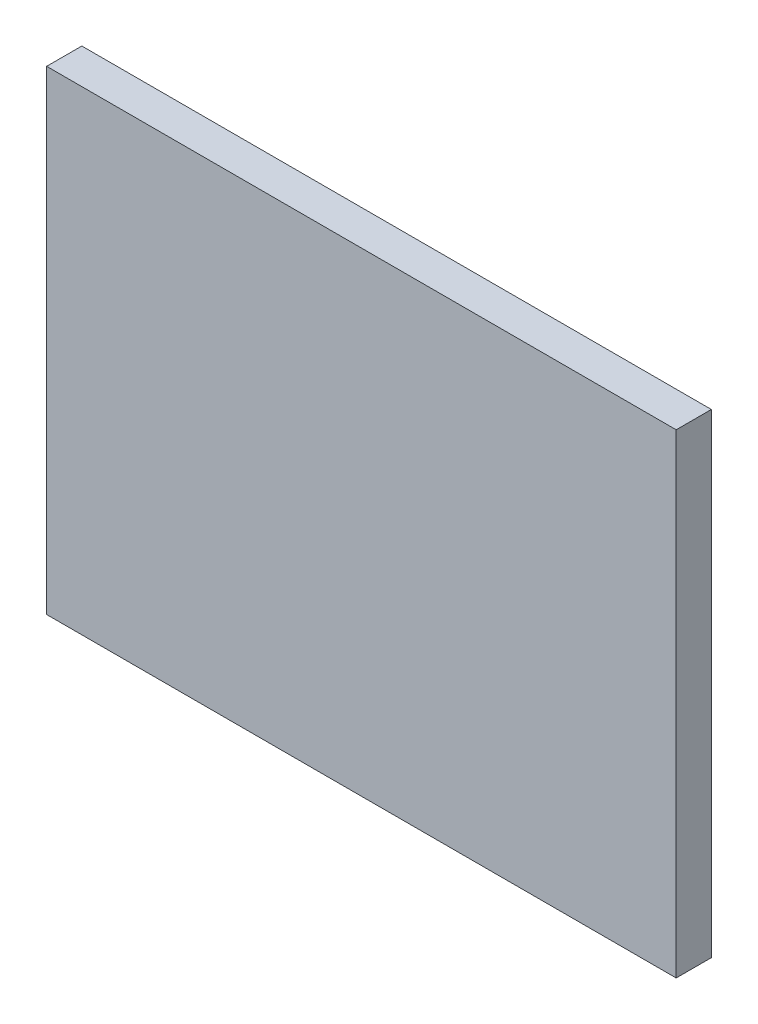
ISO-10303-21;
HEADER;
FILE_DESCRIPTION(('STEP AP214'),'2;1');
FILE_NAME('part.step','',(''),(''),'','','');
FILE_SCHEMA(('AUTOMOTIVE_DESIGN { 1 0 10303 214 1 1 1 1 }'));
ENDSEC;
DATA;
#1=APPLICATION_CONTEXT('core data for automotive mechanical design processes');
#2=APPLICATION_PROTOCOL_DEFINITION('international standard','automotive_design',2000,#1);
#3=PRODUCT_CONTEXT('',#1,'mechanical');
#4=PRODUCT('Part','Part','',(#3));
#5=PRODUCT_RELATED_PRODUCT_CATEGORY('part','',(#4));
#6=PRODUCT_DEFINITION_FORMATION('','',#4);
#7=PRODUCT_DEFINITION_CONTEXT('part definition',#1,'design');
#8=PRODUCT_DEFINITION('design','',#6,#7);
#9=PRODUCT_DEFINITION_SHAPE('','',#8);
#10=(LENGTH_UNIT() NAMED_UNIT(*) SI_UNIT(.MILLI.,.METRE.));
#11=(NAMED_UNIT(*) PLANE_ANGLE_UNIT() SI_UNIT($,.RADIAN.));
#12=(NAMED_UNIT(*) SI_UNIT($,.STERADIAN.) SOLID_ANGLE_UNIT());
#13=UNCERTAINTY_MEASURE_WITH_UNIT(LENGTH_MEASURE(1.E-05),#10,'distance_accuracy_value','');
#14=(GEOMETRIC_REPRESENTATION_CONTEXT(3) GLOBAL_UNCERTAINTY_ASSIGNED_CONTEXT((#13)) GLOBAL_UNIT_ASSIGNED_CONTEXT((#10,
#11,#12)) REPRESENTATION_CONTEXT('',''));
#15=CARTESIAN_POINT('',(0.,0.,0.));
#16=DIRECTION('',(0.,0.,1.));
#17=DIRECTION('',(1.,0.,0.));
#18=AXIS2_PLACEMENT_3D('',#15,#16,#17);
#19=CARTESIAN_POINT('',(17.9,13.5,2.));
#20=DIRECTION('',(-1.,0.,0.));
#21=DIRECTION('',(0.,0.,1.));
#22=AXIS2_PLACEMENT_3D('',#19,#20,#21);
#23=PLANE('',#22);
#24=DIRECTION('',(0.,1.,0.));
#25=VECTOR('',#24,1.);
#26=CARTESIAN_POINT('',(17.9,13.5,0.));
#27=LINE('',#26,#25);
#28=CARTESIAN_POINT('',(17.9,-13.5,0.));
#29=VERTEX_POINT('',#28);
#30=CARTESIAN_POINT('',(17.9,13.5,0.));
#31=VERTEX_POINT('',#30);
#32=EDGE_CURVE('E99',#29,#31,#27,.T.);
#33=ORIENTED_EDGE('',*,*,#32,.T.);
#34=DIRECTION('',(0.,0.,-1.));
#35=VECTOR('',#34,1.);
#36=CARTESIAN_POINT('',(17.9,13.5,2.));
#37=LINE('',#36,#35);
#38=CARTESIAN_POINT('',(17.9,13.5,2.));
#39=VERTEX_POINT('',#38);
#40=EDGE_CURVE('E11',#39,#31,#37,.T.);
#41=ORIENTED_EDGE('',*,*,#40,.F.);
#42=DIRECTION('',(0.,1.,0.));
#43=VECTOR('',#42,1.);
#44=CARTESIAN_POINT('',(17.9,13.5,2.));
#45=LINE('',#44,#43);
#46=CARTESIAN_POINT('',(17.9,-13.5,2.));
#47=VERTEX_POINT('',#46);
#48=EDGE_CURVE('E87',#47,#39,#45,.T.);
#49=ORIENTED_EDGE('',*,*,#48,.F.);
#50=DIRECTION('',(0.,0.,-1.));
#51=VECTOR('',#50,1.);
#52=CARTESIAN_POINT('',(17.9,-13.5,2.));
#53=LINE('',#52,#51);
#54=EDGE_CURVE('E95',#47,#29,#53,.T.);
#55=ORIENTED_EDGE('',*,*,#54,.T.);
#56=EDGE_LOOP('',(#33,#41,#49,#55));
#57=FACE_BOUND('',#56,.T.);
#58=ADVANCED_FACE('F36',(#57),#23,.F.);
#59=CARTESIAN_POINT('',(-17.9,13.5,2.));
#60=DIRECTION('',(0.,-1.,0.));
#61=DIRECTION('',(0.,0.,-1.));
#62=AXIS2_PLACEMENT_3D('',#59,#60,#61);
#63=PLANE('',#62);
#64=DIRECTION('',(-1.,0.,0.));
#65=VECTOR('',#64,1.);
#66=CARTESIAN_POINT('',(-17.9,13.5,0.));
#67=LINE('',#66,#65);
#68=CARTESIAN_POINT('',(-17.9,13.5,0.));
#69=VERTEX_POINT('',#68);
#70=EDGE_CURVE('E91',#31,#69,#67,.T.);
#71=ORIENTED_EDGE('',*,*,#70,.T.);
#72=DIRECTION('',(0.,0.,-1.));
#73=VECTOR('',#72,1.);
#74=CARTESIAN_POINT('',(-17.9,13.5,2.));
#75=LINE('',#74,#73);
#76=CARTESIAN_POINT('',(-17.9,13.5,2.));
#77=VERTEX_POINT('',#76);
#78=EDGE_CURVE('E44',#77,#69,#75,.T.);
#79=ORIENTED_EDGE('',*,*,#78,.F.);
#80=DIRECTION('',(-1.,0.,0.));
#81=VECTOR('',#80,1.);
#82=CARTESIAN_POINT('',(-17.9,13.5,2.));
#83=LINE('',#82,#81);
#84=EDGE_CURVE('E82',#39,#77,#83,.T.);
#85=ORIENTED_EDGE('',*,*,#84,.F.);
#86=ORIENTED_EDGE('',*,*,#40,.T.);
#87=EDGE_LOOP('',(#71,#79,#85,#86));
#88=FACE_BOUND('',#87,.T.);
#89=ADVANCED_FACE('F90',(#88),#63,.F.);
#90=CARTESIAN_POINT('',(-17.9,13.5,2.));
#91=DIRECTION('',(1.,0.,0.));
#92=DIRECTION('',(0.,1.,0.));
#93=AXIS2_PLACEMENT_3D('',#90,#91,#92);
#94=PLANE('',#93);
#95=DIRECTION('',(0.,-1.,0.));
#96=VECTOR('',#95,1.);
#97=CARTESIAN_POINT('',(-17.9,13.5,0.));
#98=LINE('',#97,#96);
#99=CARTESIAN_POINT('',(-17.9,-13.5,0.));
#100=VERTEX_POINT('',#99);
#101=EDGE_CURVE('E69',#69,#100,#98,.T.);
#102=ORIENTED_EDGE('',*,*,#101,.T.);
#103=DIRECTION('',(0.,0.,-1.));
#104=VECTOR('',#103,1.);
#105=CARTESIAN_POINT('',(-17.9,-13.5,2.));
#106=LINE('',#105,#104);
#107=CARTESIAN_POINT('',(-17.9,-13.5,2.));
#108=VERTEX_POINT('',#107);
#109=EDGE_CURVE('E92',#108,#100,#106,.T.);
#110=ORIENTED_EDGE('',*,*,#109,.F.);
#111=DIRECTION('',(0.,-1.,0.));
#112=VECTOR('',#111,1.);
#113=CARTESIAN_POINT('',(-17.9,13.5,2.));
#114=LINE('',#113,#112);
#115=EDGE_CURVE('E85',#77,#108,#114,.T.);
#116=ORIENTED_EDGE('',*,*,#115,.F.);
#117=ORIENTED_EDGE('',*,*,#78,.T.);
#118=EDGE_LOOP('',(#102,#110,#116,#117));
#119=FACE_BOUND('',#118,.T.);
#120=ADVANCED_FACE('F93',(#119),#94,.F.);
#121=CARTESIAN_POINT('',(-17.9,-13.5,2.));
#122=DIRECTION('',(0.,1.,0.));
#123=DIRECTION('',(0.,0.,1.));
#124=AXIS2_PLACEMENT_3D('',#121,#122,#123);
#125=PLANE('',#124);
#126=DIRECTION('',(1.,0.,0.));
#127=VECTOR('',#126,1.);
#128=CARTESIAN_POINT('',(-17.9,-13.5,0.));
#129=LINE('',#128,#127);
#130=EDGE_CURVE('E75',#100,#29,#129,.T.);
#131=ORIENTED_EDGE('',*,*,#130,.T.);
#132=ORIENTED_EDGE('',*,*,#54,.F.);
#133=DIRECTION('',(1.,0.,0.));
#134=VECTOR('',#133,1.);
#135=CARTESIAN_POINT('',(-17.9,-13.5,2.));
#136=LINE('',#135,#134);
#137=EDGE_CURVE('E52',#108,#47,#136,.T.);
#138=ORIENTED_EDGE('',*,*,#137,.F.);
#139=ORIENTED_EDGE('',*,*,#109,.T.);
#140=EDGE_LOOP('',(#131,#132,#138,#139));
#141=FACE_BOUND('',#140,.T.);
#142=ADVANCED_FACE('F106',(#141),#125,.F.);
#143=CARTESIAN_POINT('',(0.,0.,2.));
#144=DIRECTION('',(0.,0.,1.));
#145=DIRECTION('',(1.,0.,0.));
#146=AXIS2_PLACEMENT_3D('',#143,#144,#145);
#147=PLANE('',#146);
#148=ORIENTED_EDGE('',*,*,#48,.T.);
#149=ORIENTED_EDGE('',*,*,#84,.T.);
#150=ORIENTED_EDGE('',*,*,#115,.T.);
#151=ORIENTED_EDGE('',*,*,#137,.T.);
#152=EDGE_LOOP('',(#148,#149,#150,#151));
#153=FACE_BOUND('',#152,.T.);
#154=ADVANCED_FACE('F83',(#153),#147,.T.);
#155=CARTESIAN_POINT('',(0.,0.,0.));
#156=DIRECTION('',(0.,0.,1.));
#157=DIRECTION('',(1.,0.,0.));
#158=AXIS2_PLACEMENT_3D('',#155,#156,#157);
#159=PLANE('',#158);
#160=ORIENTED_EDGE('',*,*,#32,.F.);
#161=ORIENTED_EDGE('',*,*,#130,.F.);
#162=ORIENTED_EDGE('',*,*,#101,.F.);
#163=ORIENTED_EDGE('',*,*,#70,.F.);
#164=EDGE_LOOP('',(#160,#161,#162,#163));
#165=FACE_BOUND('',#164,.T.);
#166=ADVANCED_FACE('F109',(#165),#159,.F.);
#167=CLOSED_SHELL('',(#58,#89,#120,#142,#154,#166));
#168=MANIFOLD_SOLID_BREP('B2',#167);
#169=ADVANCED_BREP_SHAPE_REPRESENTATION('',(#18,#168),#14);
#170=SHAPE_DEFINITION_REPRESENTATION(#9,#169);
ENDSEC;
END-ISO-10303-21;
